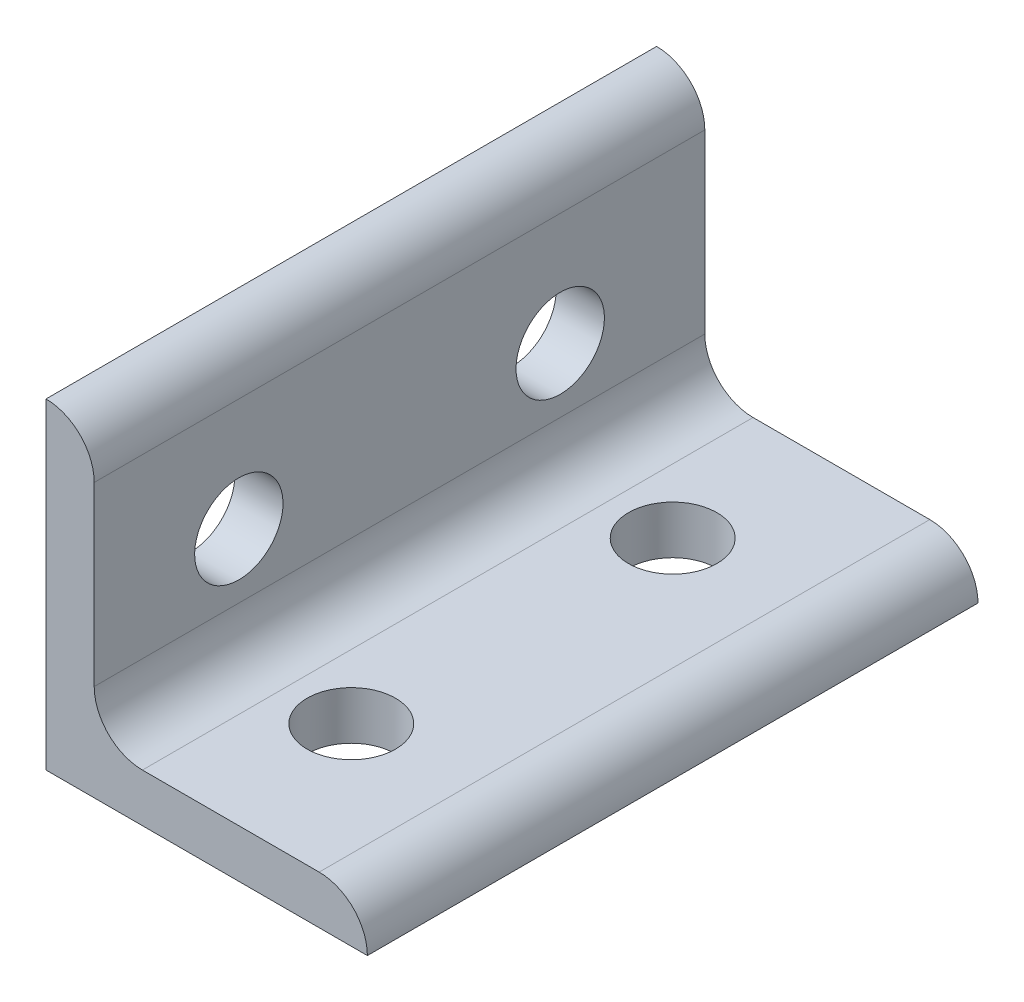
ISO-10303-21;
HEADER;
FILE_DESCRIPTION(('STEP AP214'),'2;1');
FILE_NAME('part.step','',(''),(''),'','','');
FILE_SCHEMA(('AUTOMOTIVE_DESIGN { 1 0 10303 214 1 1 1 1 }'));
ENDSEC;
DATA;
#1=APPLICATION_CONTEXT('core data for automotive mechanical design processes');
#2=APPLICATION_PROTOCOL_DEFINITION('international standard','automotive_design',2000,#1);
#3=PRODUCT_CONTEXT('',#1,'mechanical');
#4=PRODUCT('Part','Part','',(#3));
#5=PRODUCT_RELATED_PRODUCT_CATEGORY('part','',(#4));
#6=PRODUCT_DEFINITION_FORMATION('','',#4);
#7=PRODUCT_DEFINITION_CONTEXT('part definition',#1,'design');
#8=PRODUCT_DEFINITION('design','',#6,#7);
#9=PRODUCT_DEFINITION_SHAPE('','',#8);
#10=(LENGTH_UNIT() NAMED_UNIT(*) SI_UNIT(.MILLI.,.METRE.));
#11=(NAMED_UNIT(*) PLANE_ANGLE_UNIT() SI_UNIT($,.RADIAN.));
#12=(NAMED_UNIT(*) SI_UNIT($,.STERADIAN.) SOLID_ANGLE_UNIT());
#13=UNCERTAINTY_MEASURE_WITH_UNIT(LENGTH_MEASURE(1.E-05),#10,'distance_accuracy_value','');
#14=(GEOMETRIC_REPRESENTATION_CONTEXT(3) GLOBAL_UNCERTAINTY_ASSIGNED_CONTEXT((#13)) GLOBAL_UNIT_ASSIGNED_CONTEXT((#10,
#11,#12)) REPRESENTATION_CONTEXT('',''));
#15=CARTESIAN_POINT('',(0.,0.,0.));
#16=DIRECTION('',(0.,0.,1.));
#17=DIRECTION('',(1.,0.,0.));
#18=AXIS2_PLACEMENT_3D('',#15,#16,#17);
#19=CARTESIAN_POINT('',(3.,17.,19.));
#20=DIRECTION('',(-1.,0.,0.));
#21=DIRECTION('',(0.,-1.,0.));
#22=AXIS2_PLACEMENT_3D('',#19,#20,#21);
#23=PLANE('',#22);
#24=CARTESIAN_POINT('',(3.,10.,10.));
#25=DIRECTION('',(-1.,0.,0.));
#26=DIRECTION('',(0.,-1.,0.));
#27=AXIS2_PLACEMENT_3D('',#24,#25,#26);
#28=CIRCLE('',#27,2.75);
#29=CARTESIAN_POINT('',(3.,7.25,10.));
#30=VERTEX_POINT('',#29);
#31=EDGE_CURVE('E194',#30,#30,#28,.F.);
#32=ORIENTED_EDGE('',*,*,#31,.F.);
#33=EDGE_LOOP('',(#32));
#34=FACE_BOUND('',#33,.T.);
#35=DIRECTION('',(0.,1.,0.));
#36=VECTOR('',#35,1.);
#37=CARTESIAN_POINT('',(3.,17.,-19.));
#38=LINE('',#37,#36);
#39=CARTESIAN_POINT('',(3.,6.,-19.));
#40=VERTEX_POINT('',#39);
#41=CARTESIAN_POINT('',(3.,17.,-19.));
#42=VERTEX_POINT('',#41);
#43=EDGE_CURVE('E115',#40,#42,#38,.T.);
#44=ORIENTED_EDGE('',*,*,#43,.T.);
#45=DIRECTION('',(0.,0.,-1.));
#46=VECTOR('',#45,1.);
#47=CARTESIAN_POINT('',(3.,17.,19.));
#48=LINE('',#47,#46);
#49=CARTESIAN_POINT('',(3.,17.,19.));
#50=VERTEX_POINT('',#49);
#51=EDGE_CURVE('E112',#50,#42,#48,.T.);
#52=ORIENTED_EDGE('',*,*,#51,.F.);
#53=DIRECTION('',(0.,1.,0.));
#54=VECTOR('',#53,1.);
#55=CARTESIAN_POINT('',(3.,17.,19.));
#56=LINE('',#55,#54);
#57=CARTESIAN_POINT('',(3.,6.,19.));
#58=VERTEX_POINT('',#57);
#59=EDGE_CURVE('E101',#58,#50,#56,.T.);
#60=ORIENTED_EDGE('',*,*,#59,.F.);
#61=DIRECTION('',(0.,0.,-1.));
#62=VECTOR('',#61,1.);
#63=CARTESIAN_POINT('',(3.,6.,19.));
#64=LINE('',#63,#62);
#65=EDGE_CURVE('E116',#58,#40,#64,.T.);
#66=ORIENTED_EDGE('',*,*,#65,.T.);
#67=EDGE_LOOP('',(#44,#52,#60,#66));
#68=FACE_BOUND('',#67,.T.);
#69=CARTESIAN_POINT('',(3.,10.,-10.));
#70=DIRECTION('',(-1.,0.,0.));
#71=DIRECTION('',(0.,-1.,0.));
#72=AXIS2_PLACEMENT_3D('',#69,#70,#71);
#73=CIRCLE('',#72,2.75);
#74=CARTESIAN_POINT('',(3.,7.25,-10.));
#75=VERTEX_POINT('',#74);
#76=EDGE_CURVE('E187',#75,#75,#73,.F.);
#77=ORIENTED_EDGE('',*,*,#76,.F.);
#78=EDGE_LOOP('',(#77));
#79=FACE_BOUND('',#78,.T.);
#80=ADVANCED_FACE('F32',(#34,#68,#79),#23,.F.);
#81=CARTESIAN_POINT('',(0.,0.,19.));
#82=DIRECTION('',(1.,0.,0.));
#83=DIRECTION('',(0.,0.,-1.));
#84=AXIS2_PLACEMENT_3D('',#81,#82,#83);
#85=PLANE('',#84);
#86=CARTESIAN_POINT('',(0.,10.,10.));
#87=DIRECTION('',(1.,0.,0.));
#88=DIRECTION('',(0.,0.,-1.));
#89=AXIS2_PLACEMENT_3D('',#86,#87,#88);
#90=CIRCLE('',#89,2.75);
#91=CARTESIAN_POINT('',(0.,10.,7.25));
#92=VERTEX_POINT('',#91);
#93=EDGE_CURVE('E190',#92,#92,#90,.T.);
#94=ORIENTED_EDGE('',*,*,#93,.T.);
#95=EDGE_LOOP('',(#94));
#96=FACE_BOUND('',#95,.T.);
#97=DIRECTION('',(0.,-1.,0.));
#98=VECTOR('',#97,1.);
#99=CARTESIAN_POINT('',(0.,0.,-19.));
#100=LINE('',#99,#98);
#101=CARTESIAN_POINT('',(0.,20.,-19.));
#102=VERTEX_POINT('',#101);
#103=CARTESIAN_POINT('',(0.,0.,-19.));
#104=VERTEX_POINT('',#103);
#105=EDGE_CURVE('E83',#102,#104,#100,.T.);
#106=ORIENTED_EDGE('',*,*,#105,.T.);
#107=DIRECTION('',(0.,0.,-1.));
#108=VECTOR('',#107,1.);
#109=CARTESIAN_POINT('',(0.,0.,19.));
#110=LINE('',#109,#108);
#111=CARTESIAN_POINT('',(0.,0.,19.));
#112=VERTEX_POINT('',#111);
#113=EDGE_CURVE('E121',#112,#104,#110,.T.);
#114=ORIENTED_EDGE('',*,*,#113,.F.);
#115=DIRECTION('',(0.,-1.,0.));
#116=VECTOR('',#115,1.);
#117=CARTESIAN_POINT('',(0.,0.,19.));
#118=LINE('',#117,#116);
#119=CARTESIAN_POINT('',(0.,20.,19.));
#120=VERTEX_POINT('',#119);
#121=EDGE_CURVE('E51',#120,#112,#118,.T.);
#122=ORIENTED_EDGE('',*,*,#121,.F.);
#123=DIRECTION('',(0.,0.,-1.));
#124=VECTOR('',#123,1.);
#125=CARTESIAN_POINT('',(0.,20.,19.));
#126=LINE('',#125,#124);
#127=EDGE_CURVE('E117',#120,#102,#126,.T.);
#128=ORIENTED_EDGE('',*,*,#127,.T.);
#129=EDGE_LOOP('',(#106,#114,#122,#128));
#130=FACE_BOUND('',#129,.T.);
#131=CARTESIAN_POINT('',(0.,10.,-10.));
#132=DIRECTION('',(1.,0.,0.));
#133=DIRECTION('',(0.,0.,-1.));
#134=AXIS2_PLACEMENT_3D('',#131,#132,#133);
#135=CIRCLE('',#134,2.75);
#136=CARTESIAN_POINT('',(0.,10.,-12.75));
#137=VERTEX_POINT('',#136);
#138=EDGE_CURVE('E185',#137,#137,#135,.T.);
#139=ORIENTED_EDGE('',*,*,#138,.T.);
#140=EDGE_LOOP('',(#139));
#141=FACE_BOUND('',#140,.T.);
#142=ADVANCED_FACE('F178',(#96,#130,#141),#85,.F.);
#143=CARTESIAN_POINT('',(20.,0.,19.));
#144=DIRECTION('',(0.,1.,0.));
#145=DIRECTION('',(-1.,0.,0.));
#146=AXIS2_PLACEMENT_3D('',#143,#144,#145);
#147=PLANE('',#146);
#148=CARTESIAN_POINT('',(10.,0.,10.));
#149=DIRECTION('',(0.,1.,0.));
#150=DIRECTION('',(0.,0.,1.));
#151=AXIS2_PLACEMENT_3D('',#148,#149,#150);
#152=CIRCLE('',#151,2.75);
#153=CARTESIAN_POINT('',(10.,0.,12.75));
#154=VERTEX_POINT('',#153);
#155=EDGE_CURVE('E147',#154,#154,#152,.T.);
#156=ORIENTED_EDGE('',*,*,#155,.T.);
#157=EDGE_LOOP('',(#156));
#158=FACE_BOUND('',#157,.T.);
#159=DIRECTION('',(1.,0.,0.));
#160=VECTOR('',#159,1.);
#161=CARTESIAN_POINT('',(20.,0.,-19.));
#162=LINE('',#161,#160);
#163=CARTESIAN_POINT('',(20.,0.,-19.));
#164=VERTEX_POINT('',#163);
#165=EDGE_CURVE('E125',#104,#164,#162,.T.);
#166=ORIENTED_EDGE('',*,*,#165,.T.);
#167=DIRECTION('',(0.,0.,-1.));
#168=VECTOR('',#167,1.);
#169=CARTESIAN_POINT('',(20.,0.,19.));
#170=LINE('',#169,#168);
#171=CARTESIAN_POINT('',(20.,0.,19.));
#172=VERTEX_POINT('',#171);
#173=EDGE_CURVE('E11',#172,#164,#170,.T.);
#174=ORIENTED_EDGE('',*,*,#173,.F.);
#175=DIRECTION('',(1.,0.,0.));
#176=VECTOR('',#175,1.);
#177=CARTESIAN_POINT('',(20.,0.,19.));
#178=LINE('',#177,#176);
#179=EDGE_CURVE('E138',#112,#172,#178,.T.);
#180=ORIENTED_EDGE('',*,*,#179,.F.);
#181=ORIENTED_EDGE('',*,*,#113,.T.);
#182=EDGE_LOOP('',(#166,#174,#180,#181));
#183=FACE_BOUND('',#182,.T.);
#184=CARTESIAN_POINT('',(10.,0.,-10.));
#185=DIRECTION('',(0.,1.,0.));
#186=DIRECTION('',(0.,0.,1.));
#187=AXIS2_PLACEMENT_3D('',#184,#185,#186);
#188=CIRCLE('',#187,2.75);
#189=CARTESIAN_POINT('',(10.,0.,-7.25));
#190=VERTEX_POINT('',#189);
#191=EDGE_CURVE('E155',#190,#190,#188,.T.);
#192=ORIENTED_EDGE('',*,*,#191,.T.);
#193=EDGE_LOOP('',(#192));
#194=FACE_BOUND('',#193,.T.);
#195=ADVANCED_FACE('F34',(#158,#183,#194),#147,.F.);
#196=CARTESIAN_POINT('',(6.,3.,19.));
#197=DIRECTION('',(0.,-1.,0.));
#198=DIRECTION('',(1.,0.,0.));
#199=AXIS2_PLACEMENT_3D('',#196,#197,#198);
#200=PLANE('',#199);
#201=CARTESIAN_POINT('',(10.,3.,10.));
#202=DIRECTION('',(0.,-1.,0.));
#203=DIRECTION('',(1.,0.,0.));
#204=AXIS2_PLACEMENT_3D('',#201,#202,#203);
#205=CIRCLE('',#204,2.75);
#206=CARTESIAN_POINT('',(12.75,3.,10.));
#207=VERTEX_POINT('',#206);
#208=EDGE_CURVE('E129',#207,#207,#205,.F.);
#209=ORIENTED_EDGE('',*,*,#208,.F.);
#210=EDGE_LOOP('',(#209));
#211=FACE_BOUND('',#210,.T.);
#212=DIRECTION('',(-1.,0.,0.));
#213=VECTOR('',#212,1.);
#214=CARTESIAN_POINT('',(6.,3.,-19.));
#215=LINE('',#214,#213);
#216=CARTESIAN_POINT('',(17.,3.,-19.));
#217=VERTEX_POINT('',#216);
#218=CARTESIAN_POINT('',(6.,3.,-19.));
#219=VERTEX_POINT('',#218);
#220=EDGE_CURVE('E131',#217,#219,#215,.T.);
#221=ORIENTED_EDGE('',*,*,#220,.T.);
#222=DIRECTION('',(0.,0.,-1.));
#223=VECTOR('',#222,1.);
#224=CARTESIAN_POINT('',(6.,3.,19.));
#225=LINE('',#224,#223);
#226=CARTESIAN_POINT('',(6.,3.,19.));
#227=VERTEX_POINT('',#226);
#228=EDGE_CURVE('E142',#227,#219,#225,.T.);
#229=ORIENTED_EDGE('',*,*,#228,.F.);
#230=DIRECTION('',(-1.,0.,0.));
#231=VECTOR('',#230,1.);
#232=CARTESIAN_POINT('',(6.,3.,19.));
#233=LINE('',#232,#231);
#234=CARTESIAN_POINT('',(17.,3.,19.));
#235=VERTEX_POINT('',#234);
#236=EDGE_CURVE('E161',#235,#227,#233,.T.);
#237=ORIENTED_EDGE('',*,*,#236,.F.);
#238=DIRECTION('',(0.,0.,-1.));
#239=VECTOR('',#238,1.);
#240=CARTESIAN_POINT('',(17.,3.,19.));
#241=LINE('',#240,#239);
#242=EDGE_CURVE('E42',#235,#217,#241,.T.);
#243=ORIENTED_EDGE('',*,*,#242,.T.);
#244=EDGE_LOOP('',(#221,#229,#237,#243));
#245=FACE_BOUND('',#244,.T.);
#246=CARTESIAN_POINT('',(10.,3.,-10.));
#247=DIRECTION('',(0.,-1.,0.));
#248=DIRECTION('',(1.,0.,0.));
#249=AXIS2_PLACEMENT_3D('',#246,#247,#248);
#250=CIRCLE('',#249,2.75);
#251=CARTESIAN_POINT('',(12.75,3.,-10.));
#252=VERTEX_POINT('',#251);
#253=EDGE_CURVE('E36',#252,#252,#250,.F.);
#254=ORIENTED_EDGE('',*,*,#253,.F.);
#255=EDGE_LOOP('',(#254));
#256=FACE_BOUND('',#255,.T.);
#257=ADVANCED_FACE('F165',(#211,#245,#256),#200,.F.);
#258=CARTESIAN_POINT('',(17.,0.,19.));
#259=DIRECTION('',(0.,0.,-1.));
#260=DIRECTION('',(-1.,0.,0.));
#261=AXIS2_PLACEMENT_3D('',#258,#259,#260);
#262=CYLINDRICAL_SURFACE('',#261,3.);
#263=CARTESIAN_POINT('',(17.,0.,-19.));
#264=DIRECTION('',(0.,0.,1.));
#265=DIRECTION('',(1.,0.,0.));
#266=AXIS2_PLACEMENT_3D('',#263,#264,#265);
#267=CIRCLE('',#266,3.);
#268=EDGE_CURVE('E128',#164,#217,#267,.T.);
#269=ORIENTED_EDGE('',*,*,#268,.T.);
#270=ORIENTED_EDGE('',*,*,#242,.F.);
#271=CARTESIAN_POINT('',(17.,0.,19.));
#272=DIRECTION('',(0.,0.,1.));
#273=DIRECTION('',(1.,0.,0.));
#274=AXIS2_PLACEMENT_3D('',#271,#272,#273);
#275=CIRCLE('',#274,3.);
#276=EDGE_CURVE('E91',#172,#235,#275,.T.);
#277=ORIENTED_EDGE('',*,*,#276,.F.);
#278=ORIENTED_EDGE('',*,*,#173,.T.);
#279=EDGE_LOOP('',(#269,#270,#277,#278));
#280=FACE_BOUND('',#279,.T.);
#281=ADVANCED_FACE('F209',(#280),#262,.T.);
#282=CARTESIAN_POINT('',(6.,6.,19.));
#283=DIRECTION('',(0.,0.,-1.));
#284=DIRECTION('',(-1.,0.,0.));
#285=AXIS2_PLACEMENT_3D('',#282,#283,#284);
#286=CYLINDRICAL_SURFACE('',#285,3.);
#287=CARTESIAN_POINT('',(6.,6.,-19.));
#288=DIRECTION('',(0.,0.,-1.));
#289=DIRECTION('',(1.,0.,0.));
#290=AXIS2_PLACEMENT_3D('',#287,#288,#289);
#291=CIRCLE('',#290,3.);
#292=EDGE_CURVE('E133',#219,#40,#291,.T.);
#293=ORIENTED_EDGE('',*,*,#292,.T.);
#294=ORIENTED_EDGE('',*,*,#65,.F.);
#295=CARTESIAN_POINT('',(6.,6.,19.));
#296=DIRECTION('',(0.,0.,-1.));
#297=DIRECTION('',(1.,0.,0.));
#298=AXIS2_PLACEMENT_3D('',#295,#296,#297);
#299=CIRCLE('',#298,3.);
#300=EDGE_CURVE('E107',#227,#58,#299,.T.);
#301=ORIENTED_EDGE('',*,*,#300,.F.);
#302=ORIENTED_EDGE('',*,*,#228,.T.);
#303=EDGE_LOOP('',(#293,#294,#301,#302));
#304=FACE_BOUND('',#303,.T.);
#305=ADVANCED_FACE('F170',(#304),#286,.F.);
#306=CARTESIAN_POINT('',(0.,17.,19.));
#307=DIRECTION('',(0.,0.,-1.));
#308=DIRECTION('',(-1.,0.,0.));
#309=AXIS2_PLACEMENT_3D('',#306,#307,#308);
#310=CYLINDRICAL_SURFACE('',#309,3.);
#311=CARTESIAN_POINT('',(0.,17.,-19.));
#312=DIRECTION('',(0.,0.,1.));
#313=DIRECTION('',(1.,0.,0.));
#314=AXIS2_PLACEMENT_3D('',#311,#312,#313);
#315=CIRCLE('',#314,3.);
#316=EDGE_CURVE('E77',#42,#102,#315,.T.);
#317=ORIENTED_EDGE('',*,*,#316,.T.);
#318=ORIENTED_EDGE('',*,*,#127,.F.);
#319=CARTESIAN_POINT('',(0.,17.,19.));
#320=DIRECTION('',(0.,0.,1.));
#321=DIRECTION('',(1.,0.,0.));
#322=AXIS2_PLACEMENT_3D('',#319,#320,#321);
#323=CIRCLE('',#322,3.);
#324=EDGE_CURVE('E105',#50,#120,#323,.T.);
#325=ORIENTED_EDGE('',*,*,#324,.F.);
#326=ORIENTED_EDGE('',*,*,#51,.T.);
#327=EDGE_LOOP('',(#317,#318,#325,#326));
#328=FACE_BOUND('',#327,.T.);
#329=ADVANCED_FACE('F119',(#328),#310,.T.);
#330=CARTESIAN_POINT('',(0.,17.,19.));
#331=DIRECTION('',(0.,0.,1.));
#332=DIRECTION('',(1.,0.,0.));
#333=AXIS2_PLACEMENT_3D('',#330,#331,#332);
#334=PLANE('',#333);
#335=ORIENTED_EDGE('',*,*,#179,.T.);
#336=ORIENTED_EDGE('',*,*,#276,.T.);
#337=ORIENTED_EDGE('',*,*,#236,.T.);
#338=ORIENTED_EDGE('',*,*,#300,.T.);
#339=ORIENTED_EDGE('',*,*,#59,.T.);
#340=ORIENTED_EDGE('',*,*,#324,.T.);
#341=ORIENTED_EDGE('',*,*,#121,.T.);
#342=EDGE_LOOP('',(#335,#336,#337,#338,#339,#340,#341));
#343=FACE_BOUND('',#342,.T.);
#344=ADVANCED_FACE('F103',(#343),#334,.T.);
#345=CARTESIAN_POINT('',(0.,17.,-19.));
#346=DIRECTION('',(0.,0.,1.));
#347=DIRECTION('',(1.,0.,0.));
#348=AXIS2_PLACEMENT_3D('',#345,#346,#347);
#349=PLANE('',#348);
#350=ORIENTED_EDGE('',*,*,#165,.F.);
#351=ORIENTED_EDGE('',*,*,#105,.F.);
#352=ORIENTED_EDGE('',*,*,#316,.F.);
#353=ORIENTED_EDGE('',*,*,#43,.F.);
#354=ORIENTED_EDGE('',*,*,#292,.F.);
#355=ORIENTED_EDGE('',*,*,#220,.F.);
#356=ORIENTED_EDGE('',*,*,#268,.F.);
#357=EDGE_LOOP('',(#350,#351,#352,#353,#354,#355,#356));
#358=FACE_BOUND('',#357,.T.);
#359=ADVANCED_FACE('F173',(#358),#349,.F.);
#360=CARTESIAN_POINT('',(10.,20.,10.));
#361=DIRECTION('',(0.,-1.,0.));
#362=DIRECTION('',(0.,0.,-1.));
#363=AXIS2_PLACEMENT_3D('',#360,#361,#362);
#364=CYLINDRICAL_SURFACE('',#363,2.75);
#365=ORIENTED_EDGE('',*,*,#155,.F.);
#366=EDGE_LOOP('',(#365));
#367=FACE_BOUND('',#366,.T.);
#368=ORIENTED_EDGE('',*,*,#208,.T.);
#369=EDGE_LOOP('',(#368));
#370=FACE_BOUND('',#369,.T.);
#371=ADVANCED_FACE('F205',(#367,#370),#364,.F.);
#372=CARTESIAN_POINT('',(10.,20.,-10.));
#373=DIRECTION('',(0.,-1.,0.));
#374=DIRECTION('',(0.,0.,-1.));
#375=AXIS2_PLACEMENT_3D('',#372,#373,#374);
#376=CYLINDRICAL_SURFACE('',#375,2.75);
#377=ORIENTED_EDGE('',*,*,#191,.F.);
#378=EDGE_LOOP('',(#377));
#379=FACE_BOUND('',#378,.T.);
#380=ORIENTED_EDGE('',*,*,#253,.T.);
#381=EDGE_LOOP('',(#380));
#382=FACE_BOUND('',#381,.T.);
#383=ADVANCED_FACE('F201',(#379,#382),#376,.F.);
#384=CARTESIAN_POINT('',(20.,10.,10.));
#385=DIRECTION('',(-1.,0.,0.));
#386=DIRECTION('',(0.,0.,1.));
#387=AXIS2_PLACEMENT_3D('',#384,#385,#386);
#388=CYLINDRICAL_SURFACE('',#387,2.75);
#389=ORIENTED_EDGE('',*,*,#93,.F.);
#390=EDGE_LOOP('',(#389));
#391=FACE_BOUND('',#390,.T.);
#392=ORIENTED_EDGE('',*,*,#31,.T.);
#393=EDGE_LOOP('',(#392));
#394=FACE_BOUND('',#393,.T.);
#395=ADVANCED_FACE('F204',(#391,#394),#388,.F.);
#396=CARTESIAN_POINT('',(20.,10.,-10.));
#397=DIRECTION('',(-1.,0.,0.));
#398=DIRECTION('',(0.,0.,1.));
#399=AXIS2_PLACEMENT_3D('',#396,#397,#398);
#400=CYLINDRICAL_SURFACE('',#399,2.75);
#401=ORIENTED_EDGE('',*,*,#138,.F.);
#402=EDGE_LOOP('',(#401));
#403=FACE_BOUND('',#402,.T.);
#404=ORIENTED_EDGE('',*,*,#76,.T.);
#405=EDGE_LOOP('',(#404));
#406=FACE_BOUND('',#405,.T.);
#407=ADVANCED_FACE('F241',(#403,#406),#400,.F.);
#408=CLOSED_SHELL('',(#80,#142,#195,#257,#281,#305,#329,#344,#359,#371,#383,#395,#407));
#409=MANIFOLD_SOLID_BREP('B2',#408);
#410=ADVANCED_BREP_SHAPE_REPRESENTATION('',(#18,#409),#14);
#411=SHAPE_DEFINITION_REPRESENTATION(#9,#410);
ENDSEC;
END-ISO-10303-21;
